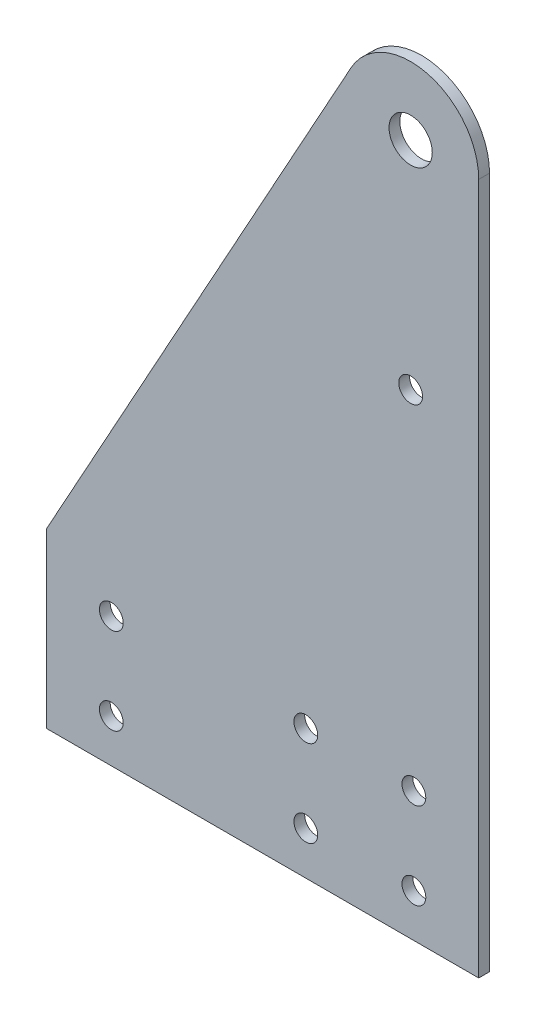
ISO-10303-21;
HEADER;
FILE_DESCRIPTION(('STEP AP214'),'2;1');
FILE_NAME('part.step','',(''),(''),'','','');
FILE_SCHEMA(('AUTOMOTIVE_DESIGN { 1 0 10303 214 1 1 1 1 }'));
ENDSEC;
DATA;
#1=APPLICATION_CONTEXT('core data for automotive mechanical design processes');
#2=APPLICATION_PROTOCOL_DEFINITION('international standard','automotive_design',2000,#1);
#3=PRODUCT_CONTEXT('',#1,'mechanical');
#4=PRODUCT('Part','Part','',(#3));
#5=PRODUCT_RELATED_PRODUCT_CATEGORY('part','',(#4));
#6=PRODUCT_DEFINITION_FORMATION('','',#4);
#7=PRODUCT_DEFINITION_CONTEXT('part definition',#1,'design');
#8=PRODUCT_DEFINITION('design','',#6,#7);
#9=PRODUCT_DEFINITION_SHAPE('','',#8);
#10=(LENGTH_UNIT() NAMED_UNIT(*) SI_UNIT(.MILLI.,.METRE.));
#11=(NAMED_UNIT(*) PLANE_ANGLE_UNIT() SI_UNIT($,.RADIAN.));
#12=(NAMED_UNIT(*) SI_UNIT($,.STERADIAN.) SOLID_ANGLE_UNIT());
#13=UNCERTAINTY_MEASURE_WITH_UNIT(LENGTH_MEASURE(1.E-05),#10,'distance_accuracy_value','');
#14=(GEOMETRIC_REPRESENTATION_CONTEXT(3) GLOBAL_UNCERTAINTY_ASSIGNED_CONTEXT((#13)) GLOBAL_UNIT_ASSIGNED_CONTEXT((#10,
#11,#12)) REPRESENTATION_CONTEXT('',''));
#15=CARTESIAN_POINT('',(0.,0.,0.));
#16=DIRECTION('',(0.,0.,1.));
#17=DIRECTION('',(1.,0.,0.));
#18=AXIS2_PLACEMENT_3D('',#15,#16,#17);
#19=CARTESIAN_POINT('',(43.5,177.8,3.175));
#20=DIRECTION('',(0.,0.,-1.));
#21=DIRECTION('',(-1.,0.,0.));
#22=AXIS2_PLACEMENT_3D('',#19,#20,#21);
#23=PLANE('',#22);
#24=DIRECTION('',(0.,-1.,0.));
#25=VECTOR('',#24,1.);
#26=CARTESIAN_POINT('',(-63.5,25.4,3.175));
#27=LINE('',#26,#25);
#28=CARTESIAN_POINT('',(-63.5,25.4,3.175));
#29=VERTEX_POINT('',#28);
#30=CARTESIAN_POINT('',(-63.5,-25.4,3.175));
#31=VERTEX_POINT('',#30);
#32=EDGE_CURVE('E125',#29,#31,#27,.T.);
#33=ORIENTED_EDGE('',*,*,#32,.T.);
#34=DIRECTION('',(1.,0.,0.));
#35=VECTOR('',#34,1.);
#36=CARTESIAN_POINT('',(-63.5,-25.4,3.175));
#37=LINE('',#36,#35);
#38=CARTESIAN_POINT('',(63.5,-25.4,3.175));
#39=VERTEX_POINT('',#38);
#40=EDGE_CURVE('E92',#31,#39,#37,.T.);
#41=ORIENTED_EDGE('',*,*,#40,.T.);
#42=DIRECTION('',(0.,1.,0.));
#43=VECTOR('',#42,1.);
#44=CARTESIAN_POINT('',(63.5,-25.4,3.175));
#45=LINE('',#44,#43);
#46=CARTESIAN_POINT('',(63.5,177.8,3.175));
#47=VERTEX_POINT('',#46);
#48=EDGE_CURVE('E96',#39,#47,#45,.T.);
#49=ORIENTED_EDGE('',*,*,#48,.T.);
#50=CARTESIAN_POINT('',(43.5,177.8,3.175));
#51=DIRECTION('',(0.,0.,1.));
#52=DIRECTION('',(-1.,0.,0.));
#53=AXIS2_PLACEMENT_3D('',#50,#51,#52);
#54=CIRCLE('',#53,20.);
#55=CARTESIAN_POINT('',(25.9918826857223,187.467772655037,3.175));
#56=VERTEX_POINT('',#55);
#57=EDGE_CURVE('E100',#47,#56,#54,.T.);
#58=ORIENTED_EDGE('',*,*,#57,.T.);
#59=DIRECTION('',(-0.483388632751874,-0.875405865713884,0.));
#60=VECTOR('',#59,1.);
#61=CARTESIAN_POINT('',(25.9918826857223,187.467772655037,3.175));
#62=LINE('',#61,#60);
#63=EDGE_CURVE('E58',#56,#29,#62,.T.);
#64=ORIENTED_EDGE('',*,*,#63,.T.);
#65=EDGE_LOOP('',(#33,#41,#49,#58,#64));
#66=FACE_BOUND('',#65,.T.);
#67=CARTESIAN_POINT('',(43.5,177.8,3.175));
#68=DIRECTION('',(0.,0.,1.));
#69=DIRECTION('',(1.,0.,0.));
#70=AXIS2_PLACEMENT_3D('',#67,#68,#69);
#71=CIRCLE('',#70,6.35);
#72=CARTESIAN_POINT('',(49.85,177.8,3.175));
#73=VERTEX_POINT('',#72);
#74=EDGE_CURVE('E120',#73,#73,#71,.T.);
#75=ORIENTED_EDGE('',*,*,#74,.F.);
#76=EDGE_LOOP('',(#75));
#77=FACE_BOUND('',#76,.T.);
#78=CARTESIAN_POINT('',(12.7,12.7,3.175));
#79=DIRECTION('',(0.,0.,1.));
#80=DIRECTION('',(1.,0.,0.));
#81=AXIS2_PLACEMENT_3D('',#78,#79,#80);
#82=CIRCLE('',#81,3.5);
#83=CARTESIAN_POINT('',(16.2,12.7,3.175));
#84=VERTEX_POINT('',#83);
#85=EDGE_CURVE('E224',#84,#84,#82,.T.);
#86=ORIENTED_EDGE('',*,*,#85,.F.);
#87=EDGE_LOOP('',(#86));
#88=FACE_BOUND('',#87,.T.);
#89=CARTESIAN_POINT('',(-44.45,12.7,3.175));
#90=DIRECTION('',(0.,0.,1.));
#91=DIRECTION('',(1.,0.,0.));
#92=AXIS2_PLACEMENT_3D('',#89,#90,#91);
#93=CIRCLE('',#92,3.5);
#94=CARTESIAN_POINT('',(-40.95,12.7,3.175));
#95=VERTEX_POINT('',#94);
#96=EDGE_CURVE('E218',#95,#95,#93,.T.);
#97=ORIENTED_EDGE('',*,*,#96,.F.);
#98=EDGE_LOOP('',(#97));
#99=FACE_BOUND('',#98,.T.);
#100=CARTESIAN_POINT('',(44.45,12.7,3.175));
#101=DIRECTION('',(0.,0.,1.));
#102=DIRECTION('',(1.,0.,0.));
#103=AXIS2_PLACEMENT_3D('',#100,#101,#102);
#104=CIRCLE('',#103,3.5);
#105=CARTESIAN_POINT('',(47.95,12.7,3.175));
#106=VERTEX_POINT('',#105);
#107=EDGE_CURVE('E212',#106,#106,#104,.T.);
#108=ORIENTED_EDGE('',*,*,#107,.F.);
#109=EDGE_LOOP('',(#108));
#110=FACE_BOUND('',#109,.T.);
#111=CARTESIAN_POINT('',(44.45,-12.7,3.175));
#112=DIRECTION('',(0.,0.,1.));
#113=DIRECTION('',(1.,0.,0.));
#114=AXIS2_PLACEMENT_3D('',#111,#112,#113);
#115=CIRCLE('',#114,3.5);
#116=CARTESIAN_POINT('',(47.95,-12.7,3.175));
#117=VERTEX_POINT('',#116);
#118=EDGE_CURVE('E206',#117,#117,#115,.T.);
#119=ORIENTED_EDGE('',*,*,#118,.F.);
#120=EDGE_LOOP('',(#119));
#121=FACE_BOUND('',#120,.T.);
#122=CARTESIAN_POINT('',(-44.45,-12.7,3.175));
#123=DIRECTION('',(0.,0.,1.));
#124=DIRECTION('',(1.,0.,0.));
#125=AXIS2_PLACEMENT_3D('',#122,#123,#124);
#126=CIRCLE('',#125,3.5);
#127=CARTESIAN_POINT('',(-40.95,-12.7,3.175));
#128=VERTEX_POINT('',#127);
#129=EDGE_CURVE('E200',#128,#128,#126,.T.);
#130=ORIENTED_EDGE('',*,*,#129,.F.);
#131=EDGE_LOOP('',(#130));
#132=FACE_BOUND('',#131,.T.);
#133=CARTESIAN_POINT('',(12.7,-12.7,3.175));
#134=DIRECTION('',(0.,0.,1.));
#135=DIRECTION('',(1.,0.,0.));
#136=AXIS2_PLACEMENT_3D('',#133,#134,#135);
#137=CIRCLE('',#136,3.5);
#138=CARTESIAN_POINT('',(16.2,-12.7,3.175));
#139=VERTEX_POINT('',#138);
#140=EDGE_CURVE('E194',#139,#139,#137,.T.);
#141=ORIENTED_EDGE('',*,*,#140,.F.);
#142=EDGE_LOOP('',(#141));
#143=FACE_BOUND('',#142,.T.);
#144=CARTESIAN_POINT('',(43.5,114.3,3.175));
#145=DIRECTION('',(0.,0.,1.));
#146=DIRECTION('',(1.,0.,0.));
#147=AXIS2_PLACEMENT_3D('',#144,#145,#146);
#148=CIRCLE('',#147,3.5);
#149=CARTESIAN_POINT('',(47.,114.3,3.175));
#150=VERTEX_POINT('',#149);
#151=EDGE_CURVE('E185',#150,#150,#148,.T.);
#152=ORIENTED_EDGE('',*,*,#151,.F.);
#153=EDGE_LOOP('',(#152));
#154=FACE_BOUND('',#153,.T.);
#155=ADVANCED_FACE('F41',(#66,#77,#88,#99,#110,#121,#132,#143,#154),#23,.F.);
#156=CARTESIAN_POINT('',(43.5,177.8,0.));
#157=DIRECTION('',(0.,0.,-1.));
#158=DIRECTION('',(-1.,0.,0.));
#159=AXIS2_PLACEMENT_3D('',#156,#157,#158);
#160=PLANE('',#159);
#161=CARTESIAN_POINT('',(12.7,-12.7,0.));
#162=DIRECTION('',(0.,0.,1.));
#163=DIRECTION('',(1.,0.,0.));
#164=AXIS2_PLACEMENT_3D('',#161,#162,#163);
#165=CIRCLE('',#164,3.5);
#166=CARTESIAN_POINT('',(16.2,-12.7,0.));
#167=VERTEX_POINT('',#166);
#168=EDGE_CURVE('E191',#167,#167,#165,.T.);
#169=ORIENTED_EDGE('',*,*,#168,.T.);
#170=EDGE_LOOP('',(#169));
#171=FACE_BOUND('',#170,.T.);
#172=CARTESIAN_POINT('',(44.45,-12.7,0.));
#173=DIRECTION('',(0.,0.,1.));
#174=DIRECTION('',(1.,0.,0.));
#175=AXIS2_PLACEMENT_3D('',#172,#173,#174);
#176=CIRCLE('',#175,3.5);
#177=CARTESIAN_POINT('',(47.95,-12.7,0.));
#178=VERTEX_POINT('',#177);
#179=EDGE_CURVE('E203',#178,#178,#176,.T.);
#180=ORIENTED_EDGE('',*,*,#179,.T.);
#181=EDGE_LOOP('',(#180));
#182=FACE_BOUND('',#181,.T.);
#183=CARTESIAN_POINT('',(-44.45,12.7,0.));
#184=DIRECTION('',(0.,0.,1.));
#185=DIRECTION('',(1.,0.,0.));
#186=AXIS2_PLACEMENT_3D('',#183,#184,#185);
#187=CIRCLE('',#186,3.5);
#188=CARTESIAN_POINT('',(-40.95,12.7,0.));
#189=VERTEX_POINT('',#188);
#190=EDGE_CURVE('E215',#189,#189,#187,.T.);
#191=ORIENTED_EDGE('',*,*,#190,.T.);
#192=EDGE_LOOP('',(#191));
#193=FACE_BOUND('',#192,.T.);
#194=CARTESIAN_POINT('',(43.5,177.8,0.));
#195=DIRECTION('',(0.,0.,1.));
#196=DIRECTION('',(1.,0.,0.));
#197=AXIS2_PLACEMENT_3D('',#194,#195,#196);
#198=CIRCLE('',#197,6.35);
#199=CARTESIAN_POINT('',(49.85,177.8,0.));
#200=VERTEX_POINT('',#199);
#201=EDGE_CURVE('E227',#200,#200,#198,.T.);
#202=ORIENTED_EDGE('',*,*,#201,.T.);
#203=EDGE_LOOP('',(#202));
#204=FACE_BOUND('',#203,.T.);
#205=DIRECTION('',(0.,-1.,0.));
#206=VECTOR('',#205,1.);
#207=CARTESIAN_POINT('',(-63.5,25.4,0.));
#208=LINE('',#207,#206);
#209=CARTESIAN_POINT('',(-63.5,25.4,0.));
#210=VERTEX_POINT('',#209);
#211=CARTESIAN_POINT('',(-63.5,-25.4,0.));
#212=VERTEX_POINT('',#211);
#213=EDGE_CURVE('E116',#210,#212,#208,.T.);
#214=ORIENTED_EDGE('',*,*,#213,.F.);
#215=DIRECTION('',(-0.483388632751874,-0.875405865713884,0.));
#216=VECTOR('',#215,1.);
#217=CARTESIAN_POINT('',(25.9918826857223,187.467772655037,0.));
#218=LINE('',#217,#216);
#219=CARTESIAN_POINT('',(25.9918826857223,187.467772655037,0.));
#220=VERTEX_POINT('',#219);
#221=EDGE_CURVE('E84',#220,#210,#218,.T.);
#222=ORIENTED_EDGE('',*,*,#221,.F.);
#223=CARTESIAN_POINT('',(43.5,177.8,0.));
#224=DIRECTION('',(0.,0.,1.));
#225=DIRECTION('',(-1.,0.,0.));
#226=AXIS2_PLACEMENT_3D('',#223,#224,#225);
#227=CIRCLE('',#226,20.);
#228=CARTESIAN_POINT('',(63.5,177.8,0.));
#229=VERTEX_POINT('',#228);
#230=EDGE_CURVE('E78',#229,#220,#227,.T.);
#231=ORIENTED_EDGE('',*,*,#230,.F.);
#232=DIRECTION('',(0.,1.,0.));
#233=VECTOR('',#232,1.);
#234=CARTESIAN_POINT('',(63.5,-25.4,0.));
#235=LINE('',#234,#233);
#236=CARTESIAN_POINT('',(63.5,-25.4,0.));
#237=VERTEX_POINT('',#236);
#238=EDGE_CURVE('E107',#237,#229,#235,.T.);
#239=ORIENTED_EDGE('',*,*,#238,.F.);
#240=DIRECTION('',(1.,0.,0.));
#241=VECTOR('',#240,1.);
#242=CARTESIAN_POINT('',(-63.5,-25.4,0.));
#243=LINE('',#242,#241);
#244=EDGE_CURVE('E119',#212,#237,#243,.T.);
#245=ORIENTED_EDGE('',*,*,#244,.F.);
#246=EDGE_LOOP('',(#214,#222,#231,#239,#245));
#247=FACE_BOUND('',#246,.T.);
#248=CARTESIAN_POINT('',(12.7,12.7,0.));
#249=DIRECTION('',(0.,0.,1.));
#250=DIRECTION('',(1.,0.,0.));
#251=AXIS2_PLACEMENT_3D('',#248,#249,#250);
#252=CIRCLE('',#251,3.5);
#253=CARTESIAN_POINT('',(16.2,12.7,0.));
#254=VERTEX_POINT('',#253);
#255=EDGE_CURVE('E221',#254,#254,#252,.T.);
#256=ORIENTED_EDGE('',*,*,#255,.T.);
#257=EDGE_LOOP('',(#256));
#258=FACE_BOUND('',#257,.T.);
#259=CARTESIAN_POINT('',(44.45,12.7,0.));
#260=DIRECTION('',(0.,0.,1.));
#261=DIRECTION('',(1.,0.,0.));
#262=AXIS2_PLACEMENT_3D('',#259,#260,#261);
#263=CIRCLE('',#262,3.5);
#264=CARTESIAN_POINT('',(47.95,12.7,0.));
#265=VERTEX_POINT('',#264);
#266=EDGE_CURVE('E209',#265,#265,#263,.T.);
#267=ORIENTED_EDGE('',*,*,#266,.T.);
#268=EDGE_LOOP('',(#267));
#269=FACE_BOUND('',#268,.T.);
#270=CARTESIAN_POINT('',(-44.45,-12.7,0.));
#271=DIRECTION('',(0.,0.,1.));
#272=DIRECTION('',(1.,0.,0.));
#273=AXIS2_PLACEMENT_3D('',#270,#271,#272);
#274=CIRCLE('',#273,3.5);
#275=CARTESIAN_POINT('',(-40.95,-12.7,0.));
#276=VERTEX_POINT('',#275);
#277=EDGE_CURVE('E197',#276,#276,#274,.T.);
#278=ORIENTED_EDGE('',*,*,#277,.T.);
#279=EDGE_LOOP('',(#278));
#280=FACE_BOUND('',#279,.T.);
#281=CARTESIAN_POINT('',(43.5,114.3,0.));
#282=DIRECTION('',(0.,0.,1.));
#283=DIRECTION('',(1.,0.,0.));
#284=AXIS2_PLACEMENT_3D('',#281,#282,#283);
#285=CIRCLE('',#284,3.5);
#286=CARTESIAN_POINT('',(47.,114.3,0.));
#287=VERTEX_POINT('',#286);
#288=EDGE_CURVE('E188',#287,#287,#285,.T.);
#289=ORIENTED_EDGE('',*,*,#288,.T.);
#290=EDGE_LOOP('',(#289));
#291=FACE_BOUND('',#290,.T.);
#292=ADVANCED_FACE('F129',(#171,#182,#193,#204,#247,#258,#269,#280,#291),#160,.T.);
#293=CARTESIAN_POINT('',(-63.5,25.4,3.175));
#294=DIRECTION('',(1.,0.,0.));
#295=DIRECTION('',(0.,0.,-1.));
#296=AXIS2_PLACEMENT_3D('',#293,#294,#295);
#297=PLANE('',#296);
#298=ORIENTED_EDGE('',*,*,#213,.T.);
#299=DIRECTION('',(0.,0.,-1.));
#300=VECTOR('',#299,1.);
#301=CARTESIAN_POINT('',(-63.5,-25.4,3.175));
#302=LINE('',#301,#300);
#303=EDGE_CURVE('E11',#31,#212,#302,.T.);
#304=ORIENTED_EDGE('',*,*,#303,.F.);
#305=ORIENTED_EDGE('',*,*,#32,.F.);
#306=DIRECTION('',(0.,0.,-1.));
#307=VECTOR('',#306,1.);
#308=CARTESIAN_POINT('',(-63.5,25.4,3.175));
#309=LINE('',#308,#307);
#310=EDGE_CURVE('E112',#29,#210,#309,.T.);
#311=ORIENTED_EDGE('',*,*,#310,.T.);
#312=EDGE_LOOP('',(#298,#304,#305,#311));
#313=FACE_BOUND('',#312,.T.);
#314=ADVANCED_FACE('F43',(#313),#297,.F.);
#315=CARTESIAN_POINT('',(-63.5,-25.4,3.175));
#316=DIRECTION('',(0.,1.,0.));
#317=DIRECTION('',(0.,0.,1.));
#318=AXIS2_PLACEMENT_3D('',#315,#316,#317);
#319=PLANE('',#318);
#320=ORIENTED_EDGE('',*,*,#244,.T.);
#321=DIRECTION('',(0.,0.,-1.));
#322=VECTOR('',#321,1.);
#323=CARTESIAN_POINT('',(63.5,-25.4,3.175));
#324=LINE('',#323,#322);
#325=EDGE_CURVE('E50',#39,#237,#324,.T.);
#326=ORIENTED_EDGE('',*,*,#325,.F.);
#327=ORIENTED_EDGE('',*,*,#40,.F.);
#328=ORIENTED_EDGE('',*,*,#303,.T.);
#329=EDGE_LOOP('',(#320,#326,#327,#328));
#330=FACE_BOUND('',#329,.T.);
#331=ADVANCED_FACE('F322',(#330),#319,.F.);
#332=CARTESIAN_POINT('',(63.5,-25.4,3.175));
#333=DIRECTION('',(-1.,0.,0.));
#334=DIRECTION('',(0.,0.,1.));
#335=AXIS2_PLACEMENT_3D('',#332,#333,#334);
#336=PLANE('',#335);
#337=ORIENTED_EDGE('',*,*,#238,.T.);
#338=DIRECTION('',(0.,0.,-1.));
#339=VECTOR('',#338,1.);
#340=CARTESIAN_POINT('',(63.5,177.8,3.175));
#341=LINE('',#340,#339);
#342=EDGE_CURVE('E104',#47,#229,#341,.T.);
#343=ORIENTED_EDGE('',*,*,#342,.F.);
#344=ORIENTED_EDGE('',*,*,#48,.F.);
#345=ORIENTED_EDGE('',*,*,#325,.T.);
#346=EDGE_LOOP('',(#337,#343,#344,#345));
#347=FACE_BOUND('',#346,.T.);
#348=ADVANCED_FACE('F105',(#347),#336,.F.);
#349=CARTESIAN_POINT('',(43.5,177.8,3.175));
#350=DIRECTION('',(0.,0.,-1.));
#351=DIRECTION('',(-1.,0.,0.));
#352=AXIS2_PLACEMENT_3D('',#349,#350,#351);
#353=CYLINDRICAL_SURFACE('',#352,20.);
#354=ORIENTED_EDGE('',*,*,#230,.T.);
#355=DIRECTION('',(0.,0.,-1.));
#356=VECTOR('',#355,1.);
#357=CARTESIAN_POINT('',(25.9918826857223,187.467772655037,3.175));
#358=LINE('',#357,#356);
#359=EDGE_CURVE('E108',#56,#220,#358,.T.);
#360=ORIENTED_EDGE('',*,*,#359,.F.);
#361=ORIENTED_EDGE('',*,*,#57,.F.);
#362=ORIENTED_EDGE('',*,*,#342,.T.);
#363=EDGE_LOOP('',(#354,#360,#361,#362));
#364=FACE_BOUND('',#363,.T.);
#365=ADVANCED_FACE('F110',(#364),#353,.T.);
#366=CARTESIAN_POINT('',(25.9918826857223,187.467772655037,3.175));
#367=DIRECTION('',(0.875405865713884,-0.483388632751874,0.));
#368=DIRECTION('',(0.483388632751874,0.875405865713884,0.));
#369=AXIS2_PLACEMENT_3D('',#366,#367,#368);
#370=PLANE('',#369);
#371=ORIENTED_EDGE('',*,*,#221,.T.);
#372=ORIENTED_EDGE('',*,*,#310,.F.);
#373=ORIENTED_EDGE('',*,*,#63,.F.);
#374=ORIENTED_EDGE('',*,*,#359,.T.);
#375=EDGE_LOOP('',(#371,#372,#373,#374));
#376=FACE_BOUND('',#375,.T.);
#377=ADVANCED_FACE('F134',(#376),#370,.F.);
#378=CARTESIAN_POINT('',(43.5,177.8,3.175));
#379=DIRECTION('',(0.,0.,-1.));
#380=DIRECTION('',(-1.,0.,0.));
#381=AXIS2_PLACEMENT_3D('',#378,#379,#380);
#382=CYLINDRICAL_SURFACE('',#381,6.35);
#383=ORIENTED_EDGE('',*,*,#74,.T.);
#384=EDGE_LOOP('',(#383));
#385=FACE_BOUND('',#384,.T.);
#386=ORIENTED_EDGE('',*,*,#201,.F.);
#387=EDGE_LOOP('',(#386));
#388=FACE_BOUND('',#387,.T.);
#389=ADVANCED_FACE('F136',(#385,#388),#382,.F.);
#390=CARTESIAN_POINT('',(12.7,12.7,3.175));
#391=DIRECTION('',(0.,0.,-1.));
#392=DIRECTION('',(-1.,0.,0.));
#393=AXIS2_PLACEMENT_3D('',#390,#391,#392);
#394=CYLINDRICAL_SURFACE('',#393,3.5);
#395=ORIENTED_EDGE('',*,*,#85,.T.);
#396=EDGE_LOOP('',(#395));
#397=FACE_BOUND('',#396,.T.);
#398=ORIENTED_EDGE('',*,*,#255,.F.);
#399=EDGE_LOOP('',(#398));
#400=FACE_BOUND('',#399,.T.);
#401=ADVANCED_FACE('F142',(#397,#400),#394,.F.);
#402=CARTESIAN_POINT('',(-44.45,12.7,3.175));
#403=DIRECTION('',(0.,0.,-1.));
#404=DIRECTION('',(-1.,0.,0.));
#405=AXIS2_PLACEMENT_3D('',#402,#403,#404);
#406=CYLINDRICAL_SURFACE('',#405,3.5);
#407=ORIENTED_EDGE('',*,*,#96,.T.);
#408=EDGE_LOOP('',(#407));
#409=FACE_BOUND('',#408,.T.);
#410=ORIENTED_EDGE('',*,*,#190,.F.);
#411=EDGE_LOOP('',(#410));
#412=FACE_BOUND('',#411,.T.);
#413=ADVANCED_FACE('F156',(#409,#412),#406,.F.);
#414=CARTESIAN_POINT('',(44.45,12.7,3.175));
#415=DIRECTION('',(0.,0.,-1.));
#416=DIRECTION('',(-1.,0.,0.));
#417=AXIS2_PLACEMENT_3D('',#414,#415,#416);
#418=CYLINDRICAL_SURFACE('',#417,3.5);
#419=ORIENTED_EDGE('',*,*,#107,.T.);
#420=EDGE_LOOP('',(#419));
#421=FACE_BOUND('',#420,.T.);
#422=ORIENTED_EDGE('',*,*,#266,.F.);
#423=EDGE_LOOP('',(#422));
#424=FACE_BOUND('',#423,.T.);
#425=ADVANCED_FACE('F160',(#421,#424),#418,.F.);
#426=CARTESIAN_POINT('',(44.45,-12.7,3.175));
#427=DIRECTION('',(0.,0.,-1.));
#428=DIRECTION('',(-1.,0.,0.));
#429=AXIS2_PLACEMENT_3D('',#426,#427,#428);
#430=CYLINDRICAL_SURFACE('',#429,3.5);
#431=ORIENTED_EDGE('',*,*,#118,.T.);
#432=EDGE_LOOP('',(#431));
#433=FACE_BOUND('',#432,.T.);
#434=ORIENTED_EDGE('',*,*,#179,.F.);
#435=EDGE_LOOP('',(#434));
#436=FACE_BOUND('',#435,.T.);
#437=ADVANCED_FACE('F164',(#433,#436),#430,.F.);
#438=CARTESIAN_POINT('',(-44.45,-12.7,3.175));
#439=DIRECTION('',(0.,0.,-1.));
#440=DIRECTION('',(-1.,0.,0.));
#441=AXIS2_PLACEMENT_3D('',#438,#439,#440);
#442=CYLINDRICAL_SURFACE('',#441,3.5);
#443=ORIENTED_EDGE('',*,*,#129,.T.);
#444=EDGE_LOOP('',(#443));
#445=FACE_BOUND('',#444,.T.);
#446=ORIENTED_EDGE('',*,*,#277,.F.);
#447=EDGE_LOOP('',(#446));
#448=FACE_BOUND('',#447,.T.);
#449=ADVANCED_FACE('F168',(#445,#448),#442,.F.);
#450=CARTESIAN_POINT('',(12.7,-12.7,3.175));
#451=DIRECTION('',(0.,0.,-1.));
#452=DIRECTION('',(-1.,0.,0.));
#453=AXIS2_PLACEMENT_3D('',#450,#451,#452);
#454=CYLINDRICAL_SURFACE('',#453,3.5);
#455=ORIENTED_EDGE('',*,*,#140,.T.);
#456=EDGE_LOOP('',(#455));
#457=FACE_BOUND('',#456,.T.);
#458=ORIENTED_EDGE('',*,*,#168,.F.);
#459=EDGE_LOOP('',(#458));
#460=FACE_BOUND('',#459,.T.);
#461=ADVANCED_FACE('F172',(#457,#460),#454,.F.);
#462=CARTESIAN_POINT('',(43.5,114.3,3.175));
#463=DIRECTION('',(0.,0.,-1.));
#464=DIRECTION('',(-1.,0.,0.));
#465=AXIS2_PLACEMENT_3D('',#462,#463,#464);
#466=CYLINDRICAL_SURFACE('',#465,3.5);
#467=ORIENTED_EDGE('',*,*,#151,.T.);
#468=EDGE_LOOP('',(#467));
#469=FACE_BOUND('',#468,.T.);
#470=ORIENTED_EDGE('',*,*,#288,.F.);
#471=EDGE_LOOP('',(#470));
#472=FACE_BOUND('',#471,.T.);
#473=ADVANCED_FACE('F176',(#469,#472),#466,.F.);
#474=CLOSED_SHELL('',(#155,#292,#314,#331,#348,#365,#377,#389,#401,#413,#425,#437,#449,#461,#473));
#475=MANIFOLD_SOLID_BREP('B2',#474);
#476=ADVANCED_BREP_SHAPE_REPRESENTATION('',(#18,#475),#14);
#477=SHAPE_DEFINITION_REPRESENTATION(#9,#476);
ENDSEC;
END-ISO-10303-21;
